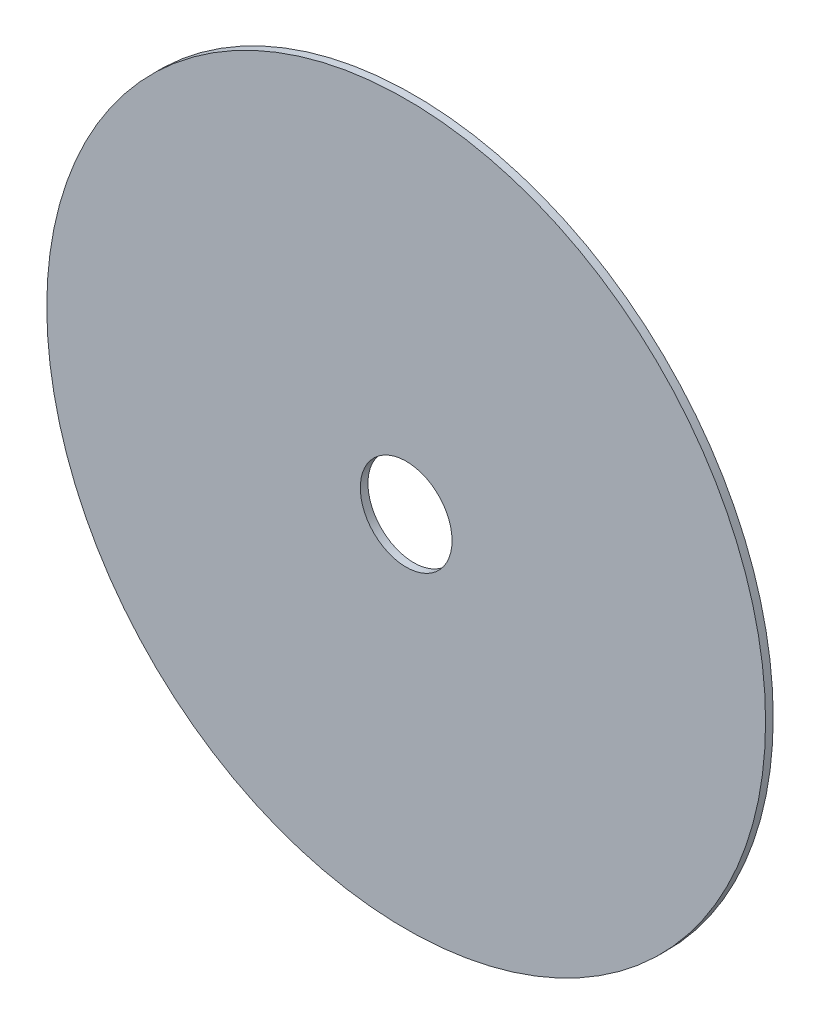
ISO-10303-21;
HEADER;
FILE_DESCRIPTION(('STEP AP214'),'2;1');
FILE_NAME('part.step','',(''),(''),'','','');
FILE_SCHEMA(('AUTOMOTIVE_DESIGN { 1 0 10303 214 1 1 1 1 }'));
ENDSEC;
DATA;
#1=APPLICATION_CONTEXT('core data for automotive mechanical design processes');
#2=APPLICATION_PROTOCOL_DEFINITION('international standard','automotive_design',2000,#1);
#3=PRODUCT_CONTEXT('',#1,'mechanical');
#4=PRODUCT('Part','Part','',(#3));
#5=PRODUCT_RELATED_PRODUCT_CATEGORY('part','',(#4));
#6=PRODUCT_DEFINITION_FORMATION('','',#4);
#7=PRODUCT_DEFINITION_CONTEXT('part definition',#1,'design');
#8=PRODUCT_DEFINITION('design','',#6,#7);
#9=PRODUCT_DEFINITION_SHAPE('','',#8);
#10=(LENGTH_UNIT() NAMED_UNIT(*) SI_UNIT(.MILLI.,.METRE.));
#11=(NAMED_UNIT(*) PLANE_ANGLE_UNIT() SI_UNIT($,.RADIAN.));
#12=(NAMED_UNIT(*) SI_UNIT($,.STERADIAN.) SOLID_ANGLE_UNIT());
#13=UNCERTAINTY_MEASURE_WITH_UNIT(LENGTH_MEASURE(1.E-05),#10,'distance_accuracy_value','');
#14=(GEOMETRIC_REPRESENTATION_CONTEXT(3) GLOBAL_UNCERTAINTY_ASSIGNED_CONTEXT((#13)) GLOBAL_UNIT_ASSIGNED_CONTEXT((#10,
#11,#12)) REPRESENTATION_CONTEXT('',''));
#15=CARTESIAN_POINT('',(0.,0.,0.));
#16=DIRECTION('',(0.,0.,1.));
#17=DIRECTION('',(1.,0.,0.));
#18=AXIS2_PLACEMENT_3D('',#15,#16,#17);
#19=CARTESIAN_POINT('',(0.,0.,1.27));
#20=DIRECTION('',(0.,0.,1.));
#21=DIRECTION('',(1.,0.,0.));
#22=AXIS2_PLACEMENT_3D('',#19,#20,#21);
#23=PLANE('',#22);
#24=CARTESIAN_POINT('',(0.,0.,1.27));
#25=DIRECTION('',(0.,0.,1.));
#26=DIRECTION('',(1.,0.,0.));
#27=AXIS2_PLACEMENT_3D('',#24,#25,#26);
#28=CIRCLE('',#27,59.69);
#29=CARTESIAN_POINT('',(59.69,0.,1.27));
#30=VERTEX_POINT('',#29);
#31=EDGE_CURVE('E10',#30,#30,#28,.T.);
#32=ORIENTED_EDGE('',*,*,#31,.T.);
#33=EDGE_LOOP('',(#32));
#34=FACE_BOUND('',#33,.T.);
#35=CARTESIAN_POINT('',(0.,0.,1.27));
#36=DIRECTION('',(0.,0.,1.));
#37=DIRECTION('',(1.,0.,0.));
#38=AXIS2_PLACEMENT_3D('',#35,#36,#37);
#39=CIRCLE('',#38,7.62);
#40=CARTESIAN_POINT('',(7.62,0.,1.27));
#41=VERTEX_POINT('',#40);
#42=EDGE_CURVE('E47',#41,#41,#39,.T.);
#43=ORIENTED_EDGE('',*,*,#42,.F.);
#44=EDGE_LOOP('',(#43));
#45=FACE_BOUND('',#44,.T.);
#46=ADVANCED_FACE('F36',(#34,#45),#23,.T.);
#47=CARTESIAN_POINT('',(0.,0.,0.));
#48=DIRECTION('',(0.,0.,1.));
#49=DIRECTION('',(1.,0.,0.));
#50=AXIS2_PLACEMENT_3D('',#47,#48,#49);
#51=PLANE('',#50);
#52=CARTESIAN_POINT('',(0.,0.,0.));
#53=DIRECTION('',(0.,0.,1.));
#54=DIRECTION('',(1.,0.,0.));
#55=AXIS2_PLACEMENT_3D('',#52,#53,#54);
#56=CIRCLE('',#55,59.69);
#57=CARTESIAN_POINT('',(59.69,0.,0.));
#58=VERTEX_POINT('',#57);
#59=EDGE_CURVE('E40',#58,#58,#56,.T.);
#60=ORIENTED_EDGE('',*,*,#59,.F.);
#61=EDGE_LOOP('',(#60));
#62=FACE_BOUND('',#61,.T.);
#63=CARTESIAN_POINT('',(0.,0.,0.));
#64=DIRECTION('',(0.,0.,1.));
#65=DIRECTION('',(1.,0.,0.));
#66=AXIS2_PLACEMENT_3D('',#63,#64,#65);
#67=CIRCLE('',#66,7.62);
#68=CARTESIAN_POINT('',(7.62,0.,0.));
#69=VERTEX_POINT('',#68);
#70=EDGE_CURVE('E49',#69,#69,#67,.T.);
#71=ORIENTED_EDGE('',*,*,#70,.T.);
#72=EDGE_LOOP('',(#71));
#73=FACE_BOUND('',#72,.T.);
#74=ADVANCED_FACE('F59',(#62,#73),#51,.F.);
#75=CARTESIAN_POINT('',(0.,0.,1.27));
#76=DIRECTION('',(0.,0.,-1.));
#77=DIRECTION('',(-1.,0.,0.));
#78=AXIS2_PLACEMENT_3D('',#75,#76,#77);
#79=CYLINDRICAL_SURFACE('',#78,59.69);
#80=ORIENTED_EDGE('',*,*,#31,.F.);
#81=EDGE_LOOP('',(#80));
#82=FACE_BOUND('',#81,.T.);
#83=ORIENTED_EDGE('',*,*,#59,.T.);
#84=EDGE_LOOP('',(#83));
#85=FACE_BOUND('',#84,.T.);
#86=ADVANCED_FACE('F38',(#82,#85),#79,.T.);
#87=CARTESIAN_POINT('',(0.,0.,1.27));
#88=DIRECTION('',(0.,0.,-1.));
#89=DIRECTION('',(-1.,0.,0.));
#90=AXIS2_PLACEMENT_3D('',#87,#88,#89);
#91=CYLINDRICAL_SURFACE('',#90,7.62);
#92=ORIENTED_EDGE('',*,*,#42,.T.);
#93=EDGE_LOOP('',(#92));
#94=FACE_BOUND('',#93,.T.);
#95=ORIENTED_EDGE('',*,*,#70,.F.);
#96=EDGE_LOOP('',(#95));
#97=FACE_BOUND('',#96,.T.);
#98=ADVANCED_FACE('F55',(#94,#97),#91,.F.);
#99=CLOSED_SHELL('',(#46,#74,#86,#98));
#100=MANIFOLD_SOLID_BREP('B2',#99);
#101=ADVANCED_BREP_SHAPE_REPRESENTATION('',(#18,#100),#14);
#102=SHAPE_DEFINITION_REPRESENTATION(#9,#101);
ENDSEC;
END-ISO-10303-21;
